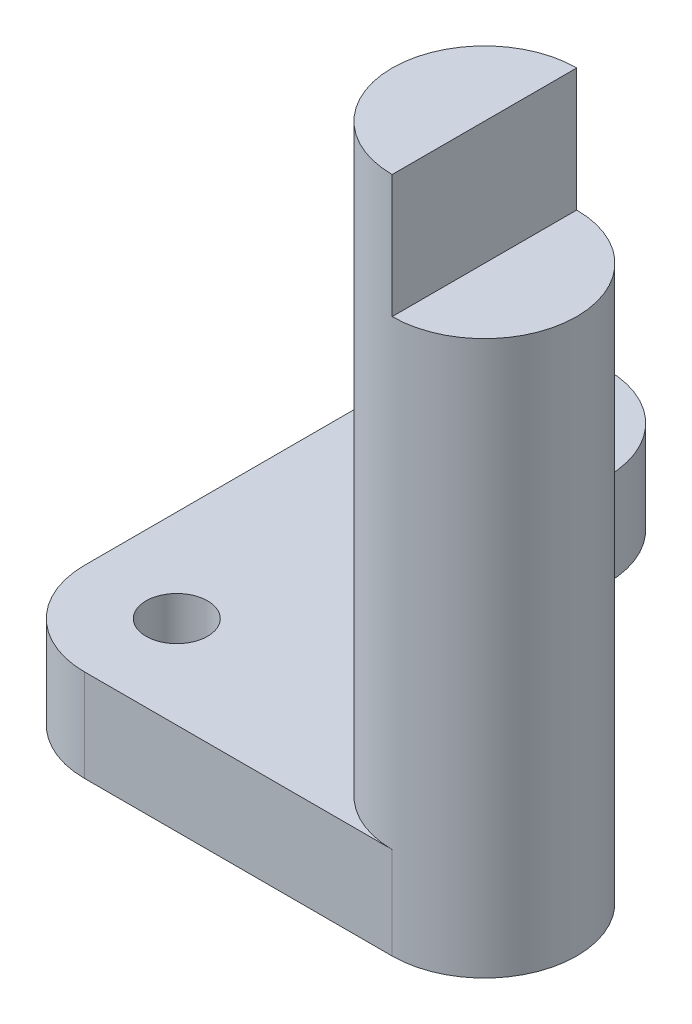
ISO-10303-21;
HEADER;
FILE_DESCRIPTION(('STEP AP214'),'2;1');
FILE_NAME('part.step','',(''),(''),'','','');
FILE_SCHEMA(('AUTOMOTIVE_DESIGN { 1 0 10303 214 1 1 1 1 }'));
ENDSEC;
DATA;
#1=APPLICATION_CONTEXT('core data for automotive mechanical design processes');
#2=APPLICATION_PROTOCOL_DEFINITION('international standard','automotive_design',2000,#1);
#3=PRODUCT_CONTEXT('',#1,'mechanical');
#4=PRODUCT('Part','Part','',(#3));
#5=PRODUCT_RELATED_PRODUCT_CATEGORY('part','',(#4));
#6=PRODUCT_DEFINITION_FORMATION('','',#4);
#7=PRODUCT_DEFINITION_CONTEXT('part definition',#1,'design');
#8=PRODUCT_DEFINITION('design','',#6,#7);
#9=PRODUCT_DEFINITION_SHAPE('','',#8);
#10=(LENGTH_UNIT() NAMED_UNIT(*) SI_UNIT(.MILLI.,.METRE.));
#11=(NAMED_UNIT(*) PLANE_ANGLE_UNIT() SI_UNIT($,.RADIAN.));
#12=(NAMED_UNIT(*) SI_UNIT($,.STERADIAN.) SOLID_ANGLE_UNIT());
#13=UNCERTAINTY_MEASURE_WITH_UNIT(LENGTH_MEASURE(1.E-05),#10,'distance_accuracy_value','');
#14=(GEOMETRIC_REPRESENTATION_CONTEXT(3) GLOBAL_UNCERTAINTY_ASSIGNED_CONTEXT((#13)) GLOBAL_UNIT_ASSIGNED_CONTEXT((#10,
#11,#12)) REPRESENTATION_CONTEXT('',''));
#15=CARTESIAN_POINT('',(0.,0.,0.));
#16=DIRECTION('',(0.,0.,1.));
#17=DIRECTION('',(1.,0.,0.));
#18=AXIS2_PLACEMENT_3D('',#15,#16,#17);
#19=CARTESIAN_POINT('',(5.,1.5,2.50000000000002));
#20=DIRECTION('',(0.,-1.,0.));
#21=DIRECTION('',(0.,0.,-1.));
#22=AXIS2_PLACEMENT_3D('',#19,#20,#21);
#23=CYLINDRICAL_SURFACE('',#22,1.5);
#24=CARTESIAN_POINT('',(5.,0.,2.50000000000002));
#25=DIRECTION('',(0.,1.,0.));
#26=DIRECTION('',(0.,0.,1.));
#27=AXIS2_PLACEMENT_3D('',#24,#25,#26);
#28=CIRCLE('',#27,1.5);
#29=CARTESIAN_POINT('',(5.,0.,4.00000000000002));
#30=VERTEX_POINT('',#29);
#31=CARTESIAN_POINT('',(5.00000000000001,0.,1.00000000000002));
#32=VERTEX_POINT('',#31);
#33=EDGE_CURVE('E204',#30,#32,#28,.T.);
#34=ORIENTED_EDGE('',*,*,#33,.T.);
#35=DIRECTION('',(0.,-1.,0.));
#36=VECTOR('',#35,1.);
#37=CARTESIAN_POINT('',(5.00000000000001,1.5,1.00000000000002));
#38=LINE('',#37,#36);
#39=CARTESIAN_POINT('',(5.00000000000001,1.5,1.00000000000002));
#40=VERTEX_POINT('',#39);
#41=EDGE_CURVE('E221',#40,#32,#38,.T.);
#42=ORIENTED_EDGE('',*,*,#41,.F.);
#43=CARTESIAN_POINT('',(5.,1.5,2.50000000000002));
#44=DIRECTION('',(0.,1.,0.));
#45=DIRECTION('',(0.,0.,1.));
#46=AXIS2_PLACEMENT_3D('',#43,#44,#45);
#47=CIRCLE('',#46,1.5);
#48=CARTESIAN_POINT('',(5.,1.5,4.00000000000002));
#49=VERTEX_POINT('',#48);
#50=EDGE_CURVE('E11',#40,#49,#47,.T.);
#51=ORIENTED_EDGE('',*,*,#50,.T.);
#52=DIRECTION('',(0.,-1.,0.));
#53=VECTOR('',#52,1.);
#54=CARTESIAN_POINT('',(5.,1.5,4.00000000000002));
#55=LINE('',#54,#53);
#56=EDGE_CURVE('E224',#49,#30,#55,.T.);
#57=ORIENTED_EDGE('',*,*,#56,.T.);
#58=EDGE_LOOP('',(#34,#42,#51,#57));
#59=FACE_BOUND('',#58,.T.);
#60=CARTESIAN_POINT('',(5.,9.,2.50000000000002));
#61=DIRECTION('',(0.,1.,0.));
#62=DIRECTION('',(0.,0.,1.));
#63=AXIS2_PLACEMENT_3D('',#60,#61,#62);
#64=CIRCLE('',#63,1.5);
#65=CARTESIAN_POINT('',(5.,9.,4.00000000000002));
#66=VERTEX_POINT('',#65);
#67=CARTESIAN_POINT('',(5.,9.,1.00000000000002));
#68=VERTEX_POINT('',#67);
#69=EDGE_CURVE('E37',#66,#68,#64,.T.);
#70=ORIENTED_EDGE('',*,*,#69,.F.);
#71=DIRECTION('',(0.,-1.,0.));
#72=VECTOR('',#71,1.);
#73=CARTESIAN_POINT('',(5.,11.,4.00000000000002));
#74=LINE('',#73,#72);
#75=CARTESIAN_POINT('',(5.,11.,4.00000000000002));
#76=VERTEX_POINT('',#75);
#77=EDGE_CURVE('E134',#76,#66,#74,.T.);
#78=ORIENTED_EDGE('',*,*,#77,.F.);
#79=CARTESIAN_POINT('',(5.,11.,2.50000000000002));
#80=DIRECTION('',(0.,1.,0.));
#81=DIRECTION('',(0.,0.,1.));
#82=AXIS2_PLACEMENT_3D('',#79,#80,#81);
#83=CIRCLE('',#82,1.5);
#84=CARTESIAN_POINT('',(5.,11.,1.00000000000002));
#85=VERTEX_POINT('',#84);
#86=EDGE_CURVE('E139',#85,#76,#83,.T.);
#87=ORIENTED_EDGE('',*,*,#86,.F.);
#88=DIRECTION('',(0.,-1.,0.));
#89=VECTOR('',#88,1.);
#90=CARTESIAN_POINT('',(5.,11.,1.00000000000002));
#91=LINE('',#90,#89);
#92=EDGE_CURVE('E136',#85,#68,#91,.T.);
#93=ORIENTED_EDGE('',*,*,#92,.T.);
#94=EDGE_LOOP('',(#70,#78,#87,#93));
#95=FACE_BOUND('',#94,.T.);
#96=ADVANCED_FACE('F33',(#59,#95),#23,.T.);
#97=CARTESIAN_POINT('',(0.,1.5,-3.));
#98=DIRECTION('',(0.,1.,0.));
#99=DIRECTION('',(0.,0.,1.));
#100=AXIS2_PLACEMENT_3D('',#97,#98,#99);
#101=PLANE('',#100);
#102=ORIENTED_EDGE('',*,*,#50,.F.);
#103=DIRECTION('',(-1.,0.,0.));
#104=VECTOR('',#103,1.);
#105=CARTESIAN_POINT('',(5.00000000000001,1.5,1.00000000000002));
#106=LINE('',#105,#104);
#107=CARTESIAN_POINT('',(1.5,1.5,1.00000000000001));
#108=VERTEX_POINT('',#107);
#109=EDGE_CURVE('E192',#40,#108,#106,.T.);
#110=ORIENTED_EDGE('',*,*,#109,.T.);
#111=DIRECTION('',(0.,0.,-1.));
#112=VECTOR('',#111,1.);
#113=CARTESIAN_POINT('',(1.5,1.5,-2.5));
#114=LINE('',#113,#112);
#115=CARTESIAN_POINT('',(1.5,1.5,-3.));
#116=VERTEX_POINT('',#115);
#117=EDGE_CURVE('E194',#108,#116,#114,.T.);
#118=ORIENTED_EDGE('',*,*,#117,.T.);
#119=CARTESIAN_POINT('',(0.,1.5,-3.));
#120=DIRECTION('',(0.,1.,0.));
#121=DIRECTION('',(0.,0.,1.));
#122=AXIS2_PLACEMENT_3D('',#119,#120,#121);
#123=CIRCLE('',#122,1.5);
#124=CARTESIAN_POINT('',(-1.5,1.5,-3.));
#125=VERTEX_POINT('',#124);
#126=EDGE_CURVE('E196',#116,#125,#123,.T.);
#127=ORIENTED_EDGE('',*,*,#126,.T.);
#128=DIRECTION('',(0.,0.,1.));
#129=VECTOR('',#128,1.);
#130=CARTESIAN_POINT('',(-1.5,1.5,-2.5));
#131=LINE('',#130,#129);
#132=CARTESIAN_POINT('',(-1.5,1.5,2.5));
#133=VERTEX_POINT('',#132);
#134=EDGE_CURVE('E184',#125,#133,#131,.T.);
#135=ORIENTED_EDGE('',*,*,#134,.T.);
#136=CARTESIAN_POINT('',(0.,1.5,2.5));
#137=DIRECTION('',(0.,1.,0.));
#138=DIRECTION('',(0.,0.,1.));
#139=AXIS2_PLACEMENT_3D('',#136,#137,#138);
#140=CIRCLE('',#139,1.5);
#141=CARTESIAN_POINT('',(0.,1.5,4.));
#142=VERTEX_POINT('',#141);
#143=EDGE_CURVE('E186',#133,#142,#140,.T.);
#144=ORIENTED_EDGE('',*,*,#143,.T.);
#145=DIRECTION('',(1.,0.,0.));
#146=VECTOR('',#145,1.);
#147=CARTESIAN_POINT('',(5.,1.5,4.00000000000002));
#148=LINE('',#147,#146);
#149=EDGE_CURVE('E189',#142,#49,#148,.T.);
#150=ORIENTED_EDGE('',*,*,#149,.T.);
#151=EDGE_LOOP('',(#102,#110,#118,#127,#135,#144,#150));
#152=FACE_BOUND('',#151,.T.);
#153=CARTESIAN_POINT('',(0.,1.5,2.5));
#154=DIRECTION('',(0.,1.,0.));
#155=DIRECTION('',(0.,0.,1.));
#156=AXIS2_PLACEMENT_3D('',#153,#154,#155);
#157=CIRCLE('',#156,0.5);
#158=CARTESIAN_POINT('',(0.,1.5,3.));
#159=VERTEX_POINT('',#158);
#160=EDGE_CURVE('E178',#159,#159,#157,.T.);
#161=ORIENTED_EDGE('',*,*,#160,.F.);
#162=EDGE_LOOP('',(#161));
#163=FACE_BOUND('',#162,.T.);
#164=DIRECTION('',(0.,0.,1.));
#165=VECTOR('',#164,1.);
#166=CARTESIAN_POINT('',(-0.5,1.5,-3.));
#167=LINE('',#166,#165);
#168=CARTESIAN_POINT('',(-0.5,1.5,-3.));
#169=VERTEX_POINT('',#168);
#170=CARTESIAN_POINT('',(-0.5,1.5,-2.));
#171=VERTEX_POINT('',#170);
#172=EDGE_CURVE('E151',#169,#171,#167,.T.);
#173=ORIENTED_EDGE('',*,*,#172,.F.);
#174=CARTESIAN_POINT('',(0.,1.5,-3.));
#175=DIRECTION('',(0.,1.,0.));
#176=DIRECTION('',(0.,0.,1.));
#177=AXIS2_PLACEMENT_3D('',#174,#175,#176);
#178=CIRCLE('',#177,0.5);
#179=CARTESIAN_POINT('',(0.5,1.5,-3.));
#180=VERTEX_POINT('',#179);
#181=EDGE_CURVE('E149',#180,#169,#178,.T.);
#182=ORIENTED_EDGE('',*,*,#181,.F.);
#183=DIRECTION('',(0.,0.,-1.));
#184=VECTOR('',#183,1.);
#185=CARTESIAN_POINT('',(0.5,1.5,-3.));
#186=LINE('',#185,#184);
#187=CARTESIAN_POINT('',(0.5,1.5,-2.));
#188=VERTEX_POINT('',#187);
#189=EDGE_CURVE('E156',#188,#180,#186,.T.);
#190=ORIENTED_EDGE('',*,*,#189,.F.);
#191=CARTESIAN_POINT('',(0.,1.5,-2.));
#192=DIRECTION('',(0.,1.,0.));
#193=DIRECTION('',(0.,0.,1.));
#194=AXIS2_PLACEMENT_3D('',#191,#192,#193);
#195=CIRCLE('',#194,0.5);
#196=EDGE_CURVE('E154',#171,#188,#195,.T.);
#197=ORIENTED_EDGE('',*,*,#196,.F.);
#198=EDGE_LOOP('',(#173,#182,#190,#197));
#199=FACE_BOUND('',#198,.T.);
#200=ADVANCED_FACE('F252',(#152,#163,#199),#101,.T.);
#201=CARTESIAN_POINT('',(0.,0.,-3.));
#202=DIRECTION('',(0.,1.,0.));
#203=DIRECTION('',(0.,0.,1.));
#204=AXIS2_PLACEMENT_3D('',#201,#202,#203);
#205=PLANE('',#204);
#206=CARTESIAN_POINT('',(0.,0.,2.5));
#207=DIRECTION('',(0.,1.,0.));
#208=DIRECTION('',(0.,0.,1.));
#209=AXIS2_PLACEMENT_3D('',#206,#207,#208);
#210=CIRCLE('',#209,0.5);
#211=CARTESIAN_POINT('',(0.,0.,3.));
#212=VERTEX_POINT('',#211);
#213=EDGE_CURVE('E177',#212,#212,#210,.T.);
#214=ORIENTED_EDGE('',*,*,#213,.T.);
#215=EDGE_LOOP('',(#214));
#216=FACE_BOUND('',#215,.T.);
#217=DIRECTION('',(0.,0.,1.));
#218=VECTOR('',#217,1.);
#219=CARTESIAN_POINT('',(-1.5,0.,-2.5));
#220=LINE('',#219,#218);
#221=CARTESIAN_POINT('',(-1.5,0.,-3.));
#222=VERTEX_POINT('',#221);
#223=CARTESIAN_POINT('',(-1.5,0.,2.5));
#224=VERTEX_POINT('',#223);
#225=EDGE_CURVE('E181',#222,#224,#220,.T.);
#226=ORIENTED_EDGE('',*,*,#225,.F.);
#227=CARTESIAN_POINT('',(0.,0.,-3.));
#228=DIRECTION('',(0.,1.,0.));
#229=DIRECTION('',(0.,0.,1.));
#230=AXIS2_PLACEMENT_3D('',#227,#228,#229);
#231=CIRCLE('',#230,1.5);
#232=CARTESIAN_POINT('',(1.5,0.,-3.));
#233=VERTEX_POINT('',#232);
#234=EDGE_CURVE('E187',#233,#222,#231,.T.);
#235=ORIENTED_EDGE('',*,*,#234,.F.);
#236=DIRECTION('',(0.,0.,-1.));
#237=VECTOR('',#236,1.);
#238=CARTESIAN_POINT('',(1.5,0.,-3.));
#239=LINE('',#238,#237);
#240=CARTESIAN_POINT('',(1.5,0.,1.00000000000001));
#241=VERTEX_POINT('',#240);
#242=EDGE_CURVE('E209',#241,#233,#239,.T.);
#243=ORIENTED_EDGE('',*,*,#242,.F.);
#244=DIRECTION('',(-1.,0.,0.));
#245=VECTOR('',#244,1.);
#246=CARTESIAN_POINT('',(5.00000000000001,0.,1.00000000000002));
#247=LINE('',#246,#245);
#248=EDGE_CURVE('E206',#32,#241,#247,.T.);
#249=ORIENTED_EDGE('',*,*,#248,.F.);
#250=ORIENTED_EDGE('',*,*,#33,.F.);
#251=DIRECTION('',(1.,0.,0.));
#252=VECTOR('',#251,1.);
#253=CARTESIAN_POINT('',(5.,0.,4.00000000000002));
#254=LINE('',#253,#252);
#255=CARTESIAN_POINT('',(0.,0.,4.));
#256=VERTEX_POINT('',#255);
#257=EDGE_CURVE('E202',#256,#30,#254,.T.);
#258=ORIENTED_EDGE('',*,*,#257,.F.);
#259=CARTESIAN_POINT('',(0.,0.,2.5));
#260=DIRECTION('',(0.,1.,0.));
#261=DIRECTION('',(0.,0.,1.));
#262=AXIS2_PLACEMENT_3D('',#259,#260,#261);
#263=CIRCLE('',#262,1.5);
#264=EDGE_CURVE('E200',#224,#256,#263,.T.);
#265=ORIENTED_EDGE('',*,*,#264,.F.);
#266=EDGE_LOOP('',(#226,#235,#243,#249,#250,#258,#265));
#267=FACE_BOUND('',#266,.T.);
#268=CARTESIAN_POINT('',(0.,0.,-3.));
#269=DIRECTION('',(0.,1.,0.));
#270=DIRECTION('',(0.,0.,1.));
#271=AXIS2_PLACEMENT_3D('',#268,#269,#270);
#272=CIRCLE('',#271,0.5);
#273=CARTESIAN_POINT('',(0.5,0.,-3.));
#274=VERTEX_POINT('',#273);
#275=CARTESIAN_POINT('',(-0.5,0.,-3.));
#276=VERTEX_POINT('',#275);
#277=EDGE_CURVE('E145',#274,#276,#272,.T.);
#278=ORIENTED_EDGE('',*,*,#277,.T.);
#279=DIRECTION('',(0.,0.,1.));
#280=VECTOR('',#279,1.);
#281=CARTESIAN_POINT('',(-0.5,0.,-3.));
#282=LINE('',#281,#280);
#283=CARTESIAN_POINT('',(-0.5,0.,-2.));
#284=VERTEX_POINT('',#283);
#285=EDGE_CURVE('E161',#276,#284,#282,.T.);
#286=ORIENTED_EDGE('',*,*,#285,.T.);
#287=CARTESIAN_POINT('',(0.,0.,-2.));
#288=DIRECTION('',(0.,1.,0.));
#289=DIRECTION('',(0.,0.,1.));
#290=AXIS2_PLACEMENT_3D('',#287,#288,#289);
#291=CIRCLE('',#290,0.5);
#292=CARTESIAN_POINT('',(0.5,0.,-2.));
#293=VERTEX_POINT('',#292);
#294=EDGE_CURVE('E164',#284,#293,#291,.T.);
#295=ORIENTED_EDGE('',*,*,#294,.T.);
#296=DIRECTION('',(0.,0.,-1.));
#297=VECTOR('',#296,1.);
#298=CARTESIAN_POINT('',(0.5,0.,-3.));
#299=LINE('',#298,#297);
#300=EDGE_CURVE('E152',#293,#274,#299,.T.);
#301=ORIENTED_EDGE('',*,*,#300,.T.);
#302=EDGE_LOOP('',(#278,#286,#295,#301));
#303=FACE_BOUND('',#302,.T.);
#304=ADVANCED_FACE('F240',(#216,#267,#303),#205,.F.);
#305=CARTESIAN_POINT('',(-1.5,1.5,-2.5));
#306=DIRECTION('',(1.,0.,0.));
#307=DIRECTION('',(0.,0.,-1.));
#308=AXIS2_PLACEMENT_3D('',#305,#306,#307);
#309=PLANE('',#308);
#310=ORIENTED_EDGE('',*,*,#225,.T.);
#311=DIRECTION('',(0.,-1.,0.));
#312=VECTOR('',#311,1.);
#313=CARTESIAN_POINT('',(-1.5,1.5,2.5));
#314=LINE('',#313,#312);
#315=EDGE_CURVE('E42',#133,#224,#314,.T.);
#316=ORIENTED_EDGE('',*,*,#315,.F.);
#317=ORIENTED_EDGE('',*,*,#134,.F.);
#318=DIRECTION('',(0.,-1.,0.));
#319=VECTOR('',#318,1.);
#320=CARTESIAN_POINT('',(-1.5,1.5,-3.));
#321=LINE('',#320,#319);
#322=EDGE_CURVE('E198',#125,#222,#321,.T.);
#323=ORIENTED_EDGE('',*,*,#322,.T.);
#324=EDGE_LOOP('',(#310,#316,#317,#323));
#325=FACE_BOUND('',#324,.T.);
#326=ADVANCED_FACE('F35',(#325),#309,.F.);
#327=CARTESIAN_POINT('',(0.,1.5,2.5));
#328=DIRECTION('',(0.,-1.,0.));
#329=DIRECTION('',(0.,0.,-1.));
#330=AXIS2_PLACEMENT_3D('',#327,#328,#329);
#331=CYLINDRICAL_SURFACE('',#330,1.5);
#332=ORIENTED_EDGE('',*,*,#264,.T.);
#333=DIRECTION('',(0.,-1.,0.));
#334=VECTOR('',#333,1.);
#335=CARTESIAN_POINT('',(0.,1.5,4.));
#336=LINE('',#335,#334);
#337=EDGE_CURVE('E227',#142,#256,#336,.T.);
#338=ORIENTED_EDGE('',*,*,#337,.F.);
#339=ORIENTED_EDGE('',*,*,#143,.F.);
#340=ORIENTED_EDGE('',*,*,#315,.T.);
#341=EDGE_LOOP('',(#332,#338,#339,#340));
#342=FACE_BOUND('',#341,.T.);
#343=ADVANCED_FACE('F234',(#342),#331,.T.);
#344=CARTESIAN_POINT('',(5.,1.5,4.00000000000002));
#345=DIRECTION('',(0.,0.,-1.));
#346=DIRECTION('',(-1.,0.,0.));
#347=AXIS2_PLACEMENT_3D('',#344,#345,#346);
#348=PLANE('',#347);
#349=ORIENTED_EDGE('',*,*,#257,.T.);
#350=ORIENTED_EDGE('',*,*,#56,.F.);
#351=ORIENTED_EDGE('',*,*,#149,.F.);
#352=ORIENTED_EDGE('',*,*,#337,.T.);
#353=EDGE_LOOP('',(#349,#350,#351,#352));
#354=FACE_BOUND('',#353,.T.);
#355=ADVANCED_FACE('F246',(#354),#348,.F.);
#356=CARTESIAN_POINT('',(5.00000000000001,1.5,1.00000000000002));
#357=DIRECTION('',(0.,0.,1.));
#358=DIRECTION('',(1.,0.,0.));
#359=AXIS2_PLACEMENT_3D('',#356,#357,#358);
#360=PLANE('',#359);
#361=ORIENTED_EDGE('',*,*,#248,.T.);
#362=DIRECTION('',(0.,-1.,0.));
#363=VECTOR('',#362,1.);
#364=CARTESIAN_POINT('',(1.5,1.5,1.00000000000001));
#365=LINE('',#364,#363);
#366=EDGE_CURVE('E218',#108,#241,#365,.T.);
#367=ORIENTED_EDGE('',*,*,#366,.F.);
#368=ORIENTED_EDGE('',*,*,#109,.F.);
#369=ORIENTED_EDGE('',*,*,#41,.T.);
#370=EDGE_LOOP('',(#361,#367,#368,#369));
#371=FACE_BOUND('',#370,.T.);
#372=ADVANCED_FACE('F262',(#371),#360,.F.);
#373=CARTESIAN_POINT('',(1.5,1.5,-3.));
#374=DIRECTION('',(-1.,0.,0.));
#375=DIRECTION('',(0.,0.,1.));
#376=AXIS2_PLACEMENT_3D('',#373,#374,#375);
#377=PLANE('',#376);
#378=ORIENTED_EDGE('',*,*,#242,.T.);
#379=DIRECTION('',(0.,-1.,0.));
#380=VECTOR('',#379,1.);
#381=CARTESIAN_POINT('',(1.5,1.5,-3.));
#382=LINE('',#381,#380);
#383=EDGE_CURVE('E215',#116,#233,#382,.T.);
#384=ORIENTED_EDGE('',*,*,#383,.F.);
#385=ORIENTED_EDGE('',*,*,#117,.F.);
#386=ORIENTED_EDGE('',*,*,#366,.T.);
#387=EDGE_LOOP('',(#378,#384,#385,#386));
#388=FACE_BOUND('',#387,.T.);
#389=ADVANCED_FACE('F264',(#388),#377,.F.);
#390=CARTESIAN_POINT('',(0.,1.5,-3.));
#391=DIRECTION('',(0.,-1.,0.));
#392=DIRECTION('',(0.,0.,-1.));
#393=AXIS2_PLACEMENT_3D('',#390,#391,#392);
#394=CYLINDRICAL_SURFACE('',#393,1.5);
#395=ORIENTED_EDGE('',*,*,#234,.T.);
#396=ORIENTED_EDGE('',*,*,#322,.F.);
#397=ORIENTED_EDGE('',*,*,#126,.F.);
#398=ORIENTED_EDGE('',*,*,#383,.T.);
#399=EDGE_LOOP('',(#395,#396,#397,#398));
#400=FACE_BOUND('',#399,.T.);
#401=ADVANCED_FACE('F258',(#400),#394,.T.);
#402=CARTESIAN_POINT('',(0.,1.5,2.5));
#403=DIRECTION('',(0.,-1.,0.));
#404=DIRECTION('',(0.,0.,-1.));
#405=AXIS2_PLACEMENT_3D('',#402,#403,#404);
#406=CYLINDRICAL_SURFACE('',#405,0.5);
#407=ORIENTED_EDGE('',*,*,#160,.T.);
#408=EDGE_LOOP('',(#407));
#409=FACE_BOUND('',#408,.T.);
#410=ORIENTED_EDGE('',*,*,#213,.F.);
#411=EDGE_LOOP('',(#410));
#412=FACE_BOUND('',#411,.T.);
#413=ADVANCED_FACE('F271',(#409,#412),#406,.F.);
#414=CARTESIAN_POINT('',(0.,1.5,-3.));
#415=DIRECTION('',(0.,-1.,0.));
#416=DIRECTION('',(0.,0.,-1.));
#417=AXIS2_PLACEMENT_3D('',#414,#415,#416);
#418=CYLINDRICAL_SURFACE('',#417,0.5);
#419=ORIENTED_EDGE('',*,*,#277,.F.);
#420=DIRECTION('',(0.,-1.,0.));
#421=VECTOR('',#420,1.);
#422=CARTESIAN_POINT('',(0.5,1.5,-3.));
#423=LINE('',#422,#421);
#424=EDGE_CURVE('E158',#180,#274,#423,.T.);
#425=ORIENTED_EDGE('',*,*,#424,.F.);
#426=ORIENTED_EDGE('',*,*,#181,.T.);
#427=DIRECTION('',(0.,-1.,0.));
#428=VECTOR('',#427,1.);
#429=CARTESIAN_POINT('',(-0.5,1.5,-3.));
#430=LINE('',#429,#428);
#431=EDGE_CURVE('E174',#169,#276,#430,.T.);
#432=ORIENTED_EDGE('',*,*,#431,.T.);
#433=EDGE_LOOP('',(#419,#425,#426,#432));
#434=FACE_BOUND('',#433,.T.);
#435=ADVANCED_FACE('F296',(#434),#418,.F.);
#436=CARTESIAN_POINT('',(-0.5,1.5,-3.));
#437=DIRECTION('',(1.,0.,0.));
#438=DIRECTION('',(0.,0.,-1.));
#439=AXIS2_PLACEMENT_3D('',#436,#437,#438);
#440=PLANE('',#439);
#441=ORIENTED_EDGE('',*,*,#285,.F.);
#442=ORIENTED_EDGE('',*,*,#431,.F.);
#443=ORIENTED_EDGE('',*,*,#172,.T.);
#444=DIRECTION('',(0.,-1.,0.));
#445=VECTOR('',#444,1.);
#446=CARTESIAN_POINT('',(-0.5,1.5,-2.));
#447=LINE('',#446,#445);
#448=EDGE_CURVE('E172',#171,#284,#447,.T.);
#449=ORIENTED_EDGE('',*,*,#448,.T.);
#450=EDGE_LOOP('',(#441,#442,#443,#449));
#451=FACE_BOUND('',#450,.T.);
#452=ADVANCED_FACE('F300',(#451),#440,.T.);
#453=CARTESIAN_POINT('',(0.,1.5,-2.));
#454=DIRECTION('',(0.,-1.,0.));
#455=DIRECTION('',(0.,0.,-1.));
#456=AXIS2_PLACEMENT_3D('',#453,#454,#455);
#457=CYLINDRICAL_SURFACE('',#456,0.5);
#458=ORIENTED_EDGE('',*,*,#294,.F.);
#459=ORIENTED_EDGE('',*,*,#448,.F.);
#460=ORIENTED_EDGE('',*,*,#196,.T.);
#461=DIRECTION('',(0.,-1.,0.));
#462=VECTOR('',#461,1.);
#463=CARTESIAN_POINT('',(0.5,1.5,-2.));
#464=LINE('',#463,#462);
#465=EDGE_CURVE('E57',#188,#293,#464,.T.);
#466=ORIENTED_EDGE('',*,*,#465,.T.);
#467=EDGE_LOOP('',(#458,#459,#460,#466));
#468=FACE_BOUND('',#467,.T.);
#469=ADVANCED_FACE('F304',(#468),#457,.F.);
#470=CARTESIAN_POINT('',(0.5,1.5,-3.));
#471=DIRECTION('',(-1.,0.,0.));
#472=DIRECTION('',(0.,0.,1.));
#473=AXIS2_PLACEMENT_3D('',#470,#471,#472);
#474=PLANE('',#473);
#475=ORIENTED_EDGE('',*,*,#300,.F.);
#476=ORIENTED_EDGE('',*,*,#465,.F.);
#477=ORIENTED_EDGE('',*,*,#189,.T.);
#478=ORIENTED_EDGE('',*,*,#424,.T.);
#479=EDGE_LOOP('',(#475,#476,#477,#478));
#480=FACE_BOUND('',#479,.T.);
#481=ADVANCED_FACE('F308',(#480),#474,.T.);
#482=CARTESIAN_POINT('',(0.,9.,0.));
#483=DIRECTION('',(0.,1.,0.));
#484=DIRECTION('',(0.,0.,1.));
#485=AXIS2_PLACEMENT_3D('',#482,#483,#484);
#486=PLANE('',#485);
#487=DIRECTION('',(0.,0.,-1.));
#488=VECTOR('',#487,1.);
#489=CARTESIAN_POINT('',(5.,9.,1.00000000000002));
#490=LINE('',#489,#488);
#491=EDGE_CURVE('E49',#66,#68,#490,.T.);
#492=ORIENTED_EDGE('',*,*,#491,.F.);
#493=ORIENTED_EDGE('',*,*,#69,.T.);
#494=EDGE_LOOP('',(#492,#493));
#495=FACE_BOUND('',#494,.T.);
#496=ADVANCED_FACE('F312',(#495),#486,.T.);
#497=CARTESIAN_POINT('',(5.,11.,1.00000000000002));
#498=DIRECTION('',(-1.,0.,0.));
#499=DIRECTION('',(0.,0.,1.));
#500=AXIS2_PLACEMENT_3D('',#497,#498,#499);
#501=PLANE('',#500);
#502=ORIENTED_EDGE('',*,*,#491,.T.);
#503=ORIENTED_EDGE('',*,*,#92,.F.);
#504=DIRECTION('',(0.,0.,-1.));
#505=VECTOR('',#504,1.);
#506=CARTESIAN_POINT('',(5.,11.,1.00000000000002));
#507=LINE('',#506,#505);
#508=EDGE_CURVE('E130',#76,#85,#507,.T.);
#509=ORIENTED_EDGE('',*,*,#508,.F.);
#510=ORIENTED_EDGE('',*,*,#77,.T.);
#511=EDGE_LOOP('',(#502,#503,#509,#510));
#512=FACE_BOUND('',#511,.T.);
#513=ADVANCED_FACE('F132',(#512),#501,.F.);
#514=CARTESIAN_POINT('',(5.,11.,2.50000000000002));
#515=DIRECTION('',(0.,1.,0.));
#516=DIRECTION('',(0.,0.,1.));
#517=AXIS2_PLACEMENT_3D('',#514,#515,#516);
#518=PLANE('',#517);
#519=ORIENTED_EDGE('',*,*,#86,.T.);
#520=ORIENTED_EDGE('',*,*,#508,.T.);
#521=EDGE_LOOP('',(#519,#520));
#522=FACE_BOUND('',#521,.T.);
#523=ADVANCED_FACE('F141',(#522),#518,.T.);
#524=CLOSED_SHELL('',(#96,#200,#304,#326,#343,#355,#372,#389,#401,#413,#435,#452,#469,#481,#496,
#513,#523));
#525=MANIFOLD_SOLID_BREP('B2',#524);
#526=ADVANCED_BREP_SHAPE_REPRESENTATION('',(#18,#525),#14);
#527=SHAPE_DEFINITION_REPRESENTATION(#9,#526);
ENDSEC;
END-ISO-10303-21;
